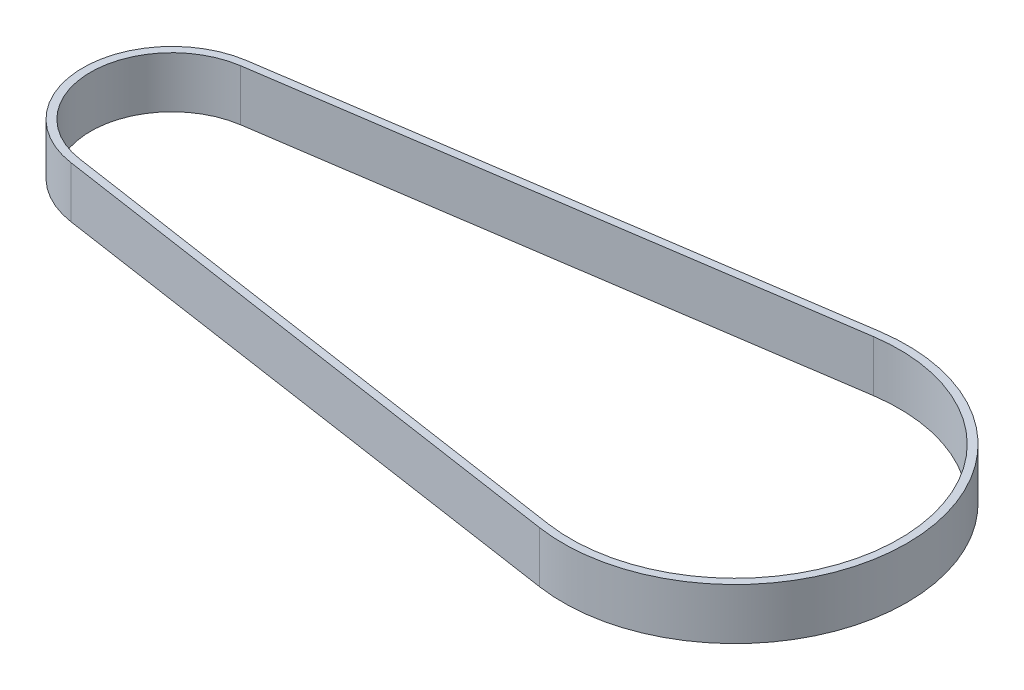
ISO-10303-21;
HEADER;
FILE_DESCRIPTION(('STEP AP214'),'2;1');
FILE_NAME('part.step','',(''),(''),'','','');
FILE_SCHEMA(('AUTOMOTIVE_DESIGN { 1 0 10303 214 1 1 1 1 }'));
ENDSEC;
DATA;
#1=APPLICATION_CONTEXT('core data for automotive mechanical design processes');
#2=APPLICATION_PROTOCOL_DEFINITION('international standard','automotive_design',2000,#1);
#3=PRODUCT_CONTEXT('',#1,'mechanical');
#4=PRODUCT('Part','Part','',(#3));
#5=PRODUCT_RELATED_PRODUCT_CATEGORY('part','',(#4));
#6=PRODUCT_DEFINITION_FORMATION('','',#4);
#7=PRODUCT_DEFINITION_CONTEXT('part definition',#1,'design');
#8=PRODUCT_DEFINITION('design','',#6,#7);
#9=PRODUCT_DEFINITION_SHAPE('','',#8);
#10=(LENGTH_UNIT() NAMED_UNIT(*) SI_UNIT(.MILLI.,.METRE.));
#11=(NAMED_UNIT(*) PLANE_ANGLE_UNIT() SI_UNIT($,.RADIAN.));
#12=(NAMED_UNIT(*) SI_UNIT($,.STERADIAN.) SOLID_ANGLE_UNIT());
#13=UNCERTAINTY_MEASURE_WITH_UNIT(LENGTH_MEASURE(1.E-05),#10,'distance_accuracy_value','');
#14=(GEOMETRIC_REPRESENTATION_CONTEXT(3) GLOBAL_UNCERTAINTY_ASSIGNED_CONTEXT((#13)) GLOBAL_UNIT_ASSIGNED_CONTEXT((#10,
#11,#12)) REPRESENTATION_CONTEXT('',''));
#15=CARTESIAN_POINT('',(0.,0.,0.));
#16=DIRECTION('',(0.,0.,1.));
#17=DIRECTION('',(1.,0.,0.));
#18=AXIS2_PLACEMENT_3D('',#15,#16,#17);
#19=CARTESIAN_POINT('',(-71.6145937328295,10.,0.));
#20=DIRECTION('',(0.,1.,0.));
#21=DIRECTION('',(0.,0.,1.));
#22=AXIS2_PLACEMENT_3D('',#19,#20,#21);
#23=PLANE('',#22);
#24=CARTESIAN_POINT('',(-71.6145937328295,10.,0.));
#25=DIRECTION('',(0.,1.,0.));
#26=DIRECTION('',(0.,0.,1.));
#27=AXIS2_PLACEMENT_3D('',#24,#25,#26);
#28=CIRCLE('',#27,17.415);
#29=CARTESIAN_POINT('',(-74.1745987328295,10.,-17.2258120098872));
#30=VERTEX_POINT('',#29);
#31=CARTESIAN_POINT('',(-74.1745987328296,10.,17.2258120098872));
#32=VERTEX_POINT('',#31);
#33=EDGE_CURVE('E153',#30,#32,#28,.T.);
#34=ORIENTED_EDGE('',*,*,#33,.T.);
#35=DIRECTION('',(0.989136492098032,0.,0.147));
#36=VECTOR('',#35,1.);
#37=CARTESIAN_POINT('',(-74.1745987328296,10.,17.2258120098872));
#38=LINE('',#37,#36);
#39=CARTESIAN_POINT('',(33.4484112671705,10.,33.2201490871124));
#40=VERTEX_POINT('',#39);
#41=EDGE_CURVE('E157',#32,#40,#38,.T.);
#42=ORIENTED_EDGE('',*,*,#41,.T.);
#43=CARTESIAN_POINT('',(38.3854062671705,10.,0.));
#44=DIRECTION('',(0.,1.,0.));
#45=DIRECTION('',(0.,0.,1.));
#46=AXIS2_PLACEMENT_3D('',#43,#44,#45);
#47=CIRCLE('',#46,33.585);
#48=CARTESIAN_POINT('',(33.4484112671705,10.,-33.2201490871124));
#49=VERTEX_POINT('',#48);
#50=EDGE_CURVE('E161',#40,#49,#47,.T.);
#51=ORIENTED_EDGE('',*,*,#50,.T.);
#52=DIRECTION('',(-0.989136492098032,0.,0.147));
#53=VECTOR('',#52,1.);
#54=CARTESIAN_POINT('',(-74.1745987328295,10.,-17.2258120098872));
#55=LINE('',#54,#53);
#56=EDGE_CURVE('E164',#49,#30,#55,.T.);
#57=ORIENTED_EDGE('',*,*,#56,.T.);
#58=EDGE_LOOP('',(#34,#42,#51,#57));
#59=FACE_BOUND('',#58,.T.);
#60=DIRECTION('',(0.989136492098032,0.,0.147));
#61=VECTOR('',#60,1.);
#62=CARTESIAN_POINT('',(-73.9540987328296,10.,15.7421072717402));
#63=LINE('',#62,#61);
#64=CARTESIAN_POINT('',(-73.9540987328296,10.,15.7421072717402));
#65=VERTEX_POINT('',#64);
#66=CARTESIAN_POINT('',(33.6689112671704,10.,31.7364443489654));
#67=VERTEX_POINT('',#66);
#68=EDGE_CURVE('E114',#65,#67,#63,.T.);
#69=ORIENTED_EDGE('',*,*,#68,.F.);
#70=CARTESIAN_POINT('',(-71.6145937328295,10.,0.));
#71=DIRECTION('',(0.,1.,0.));
#72=DIRECTION('',(0.,0.,1.));
#73=AXIS2_PLACEMENT_3D('',#70,#71,#72);
#74=CIRCLE('',#73,15.915);
#75=CARTESIAN_POINT('',(-73.9540987328296,10.,-15.7421072717402));
#76=VERTEX_POINT('',#75);
#77=EDGE_CURVE('E105',#76,#65,#74,.T.);
#78=ORIENTED_EDGE('',*,*,#77,.F.);
#79=DIRECTION('',(-0.989136492098032,0.,0.147));
#80=VECTOR('',#79,1.);
#81=CARTESIAN_POINT('',(-73.9540987328296,10.,-15.7421072717402));
#82=LINE('',#81,#80);
#83=CARTESIAN_POINT('',(33.6689112671705,10.,-31.7364443489653));
#84=VERTEX_POINT('',#83);
#85=EDGE_CURVE('E131',#84,#76,#82,.T.);
#86=ORIENTED_EDGE('',*,*,#85,.F.);
#87=CARTESIAN_POINT('',(38.3854062671705,10.,0.));
#88=DIRECTION('',(0.,1.,0.));
#89=DIRECTION('',(0.,0.,1.));
#90=AXIS2_PLACEMENT_3D('',#87,#88,#89);
#91=CIRCLE('',#90,32.085);
#92=EDGE_CURVE('E127',#67,#84,#91,.T.);
#93=ORIENTED_EDGE('',*,*,#92,.F.);
#94=EDGE_LOOP('',(#69,#78,#86,#93));
#95=FACE_BOUND('',#94,.T.);
#96=ADVANCED_FACE('F39',(#59,#95),#23,.T.);
#97=CARTESIAN_POINT('',(-71.6145937328295,0.,0.));
#98=DIRECTION('',(0.,1.,0.));
#99=DIRECTION('',(0.,0.,1.));
#100=AXIS2_PLACEMENT_3D('',#97,#98,#99);
#101=PLANE('',#100);
#102=CARTESIAN_POINT('',(-71.6145937328295,0.,0.));
#103=DIRECTION('',(0.,1.,0.));
#104=DIRECTION('',(0.,0.,1.));
#105=AXIS2_PLACEMENT_3D('',#102,#103,#104);
#106=CIRCLE('',#105,17.415);
#107=CARTESIAN_POINT('',(-74.1745987328295,0.,-17.2258120098872));
#108=VERTEX_POINT('',#107);
#109=CARTESIAN_POINT('',(-74.1745987328296,0.,17.2258120098872));
#110=VERTEX_POINT('',#109);
#111=EDGE_CURVE('E123',#108,#110,#106,.T.);
#112=ORIENTED_EDGE('',*,*,#111,.F.);
#113=DIRECTION('',(-0.989136492098032,0.,0.147));
#114=VECTOR('',#113,1.);
#115=CARTESIAN_POINT('',(-74.1745987328295,0.,-17.2258120098872));
#116=LINE('',#115,#114);
#117=CARTESIAN_POINT('',(33.4484112671705,0.,-33.2201490871124));
#118=VERTEX_POINT('',#117);
#119=EDGE_CURVE('E158',#118,#108,#116,.T.);
#120=ORIENTED_EDGE('',*,*,#119,.F.);
#121=CARTESIAN_POINT('',(38.3854062671705,0.,0.));
#122=DIRECTION('',(0.,1.,0.));
#123=DIRECTION('',(0.,0.,1.));
#124=AXIS2_PLACEMENT_3D('',#121,#122,#123);
#125=CIRCLE('',#124,33.585);
#126=CARTESIAN_POINT('',(33.4484112671705,0.,33.2201490871124));
#127=VERTEX_POINT('',#126);
#128=EDGE_CURVE('E174',#127,#118,#125,.T.);
#129=ORIENTED_EDGE('',*,*,#128,.F.);
#130=DIRECTION('',(0.989136492098032,0.,0.147));
#131=VECTOR('',#130,1.);
#132=CARTESIAN_POINT('',(-74.1745987328296,0.,17.2258120098872));
#133=LINE('',#132,#131);
#134=EDGE_CURVE('E171',#110,#127,#133,.T.);
#135=ORIENTED_EDGE('',*,*,#134,.F.);
#136=EDGE_LOOP('',(#112,#120,#129,#135));
#137=FACE_BOUND('',#136,.T.);
#138=CARTESIAN_POINT('',(-71.6145937328295,0.,0.));
#139=DIRECTION('',(0.,1.,0.));
#140=DIRECTION('',(0.,0.,1.));
#141=AXIS2_PLACEMENT_3D('',#138,#139,#140);
#142=CIRCLE('',#141,15.915);
#143=CARTESIAN_POINT('',(-73.9540987328296,0.,-15.7421072717402));
#144=VERTEX_POINT('',#143);
#145=CARTESIAN_POINT('',(-73.9540987328296,0.,15.7421072717402));
#146=VERTEX_POINT('',#145);
#147=EDGE_CURVE('E63',#144,#146,#142,.T.);
#148=ORIENTED_EDGE('',*,*,#147,.T.);
#149=DIRECTION('',(0.989136492098032,0.,0.147));
#150=VECTOR('',#149,1.);
#151=CARTESIAN_POINT('',(-73.9540987328296,0.,15.7421072717402));
#152=LINE('',#151,#150);
#153=CARTESIAN_POINT('',(33.6689112671704,0.,31.7364443489654));
#154=VERTEX_POINT('',#153);
#155=EDGE_CURVE('E121',#146,#154,#152,.T.);
#156=ORIENTED_EDGE('',*,*,#155,.T.);
#157=CARTESIAN_POINT('',(38.3854062671705,0.,0.));
#158=DIRECTION('',(0.,1.,0.));
#159=DIRECTION('',(0.,0.,1.));
#160=AXIS2_PLACEMENT_3D('',#157,#158,#159);
#161=CIRCLE('',#160,32.085);
#162=CARTESIAN_POINT('',(33.6689112671705,0.,-31.7364443489653));
#163=VERTEX_POINT('',#162);
#164=EDGE_CURVE('E140',#154,#163,#161,.T.);
#165=ORIENTED_EDGE('',*,*,#164,.T.);
#166=DIRECTION('',(-0.989136492098032,0.,0.147));
#167=VECTOR('',#166,1.);
#168=CARTESIAN_POINT('',(-73.9540987328296,0.,-15.7421072717402));
#169=LINE('',#168,#167);
#170=EDGE_CURVE('E115',#163,#144,#169,.T.);
#171=ORIENTED_EDGE('',*,*,#170,.T.);
#172=EDGE_LOOP('',(#148,#156,#165,#171));
#173=FACE_BOUND('',#172,.T.);
#174=ADVANCED_FACE('F197',(#137,#173),#101,.F.);
#175=CARTESIAN_POINT('',(-71.6145937328295,10.,0.));
#176=DIRECTION('',(0.,-1.,0.));
#177=DIRECTION('',(0.,0.,-1.));
#178=AXIS2_PLACEMENT_3D('',#175,#176,#177);
#179=CYLINDRICAL_SURFACE('',#178,17.415);
#180=ORIENTED_EDGE('',*,*,#111,.T.);
#181=DIRECTION('',(0.,-1.,0.));
#182=VECTOR('',#181,1.);
#183=CARTESIAN_POINT('',(-74.1745987328296,10.,17.2258120098872));
#184=LINE('',#183,#182);
#185=EDGE_CURVE('E11',#32,#110,#184,.T.);
#186=ORIENTED_EDGE('',*,*,#185,.F.);
#187=ORIENTED_EDGE('',*,*,#33,.F.);
#188=DIRECTION('',(0.,-1.,0.));
#189=VECTOR('',#188,1.);
#190=CARTESIAN_POINT('',(-74.1745987328295,10.,-17.2258120098872));
#191=LINE('',#190,#189);
#192=EDGE_CURVE('E167',#30,#108,#191,.T.);
#193=ORIENTED_EDGE('',*,*,#192,.T.);
#194=EDGE_LOOP('',(#180,#186,#187,#193));
#195=FACE_BOUND('',#194,.T.);
#196=ADVANCED_FACE('F41',(#195),#179,.T.);
#197=CARTESIAN_POINT('',(-74.1745987328296,10.,17.2258120098872));
#198=DIRECTION('',(0.147,0.,-0.989136492098032));
#199=DIRECTION('',(-0.989136492098032,0.,-0.147));
#200=AXIS2_PLACEMENT_3D('',#197,#198,#199);
#201=PLANE('',#200);
#202=ORIENTED_EDGE('',*,*,#134,.T.);
#203=DIRECTION('',(0.,-1.,0.));
#204=VECTOR('',#203,1.);
#205=CARTESIAN_POINT('',(33.4484112671705,10.,33.2201490871124));
#206=LINE('',#205,#204);
#207=EDGE_CURVE('E48',#40,#127,#206,.T.);
#208=ORIENTED_EDGE('',*,*,#207,.F.);
#209=ORIENTED_EDGE('',*,*,#41,.F.);
#210=ORIENTED_EDGE('',*,*,#185,.T.);
#211=EDGE_LOOP('',(#202,#208,#209,#210));
#212=FACE_BOUND('',#211,.T.);
#213=ADVANCED_FACE('F207',(#212),#201,.F.);
#214=CARTESIAN_POINT('',(38.3854062671705,10.,0.));
#215=DIRECTION('',(0.,-1.,0.));
#216=DIRECTION('',(0.,0.,-1.));
#217=AXIS2_PLACEMENT_3D('',#214,#215,#216);
#218=CYLINDRICAL_SURFACE('',#217,33.585);
#219=ORIENTED_EDGE('',*,*,#128,.T.);
#220=DIRECTION('',(0.,-1.,0.));
#221=VECTOR('',#220,1.);
#222=CARTESIAN_POINT('',(33.4484112671705,10.,-33.2201490871124));
#223=LINE('',#222,#221);
#224=EDGE_CURVE('E182',#49,#118,#223,.T.);
#225=ORIENTED_EDGE('',*,*,#224,.F.);
#226=ORIENTED_EDGE('',*,*,#50,.F.);
#227=ORIENTED_EDGE('',*,*,#207,.T.);
#228=EDGE_LOOP('',(#219,#225,#226,#227));
#229=FACE_BOUND('',#228,.T.);
#230=ADVANCED_FACE('F191',(#229),#218,.T.);
#231=CARTESIAN_POINT('',(-74.1745987328295,10.,-17.2258120098872));
#232=DIRECTION('',(0.147,0.,0.989136492098032));
#233=DIRECTION('',(0.989136492098032,0.,-0.147));
#234=AXIS2_PLACEMENT_3D('',#231,#232,#233);
#235=PLANE('',#234);
#236=ORIENTED_EDGE('',*,*,#119,.T.);
#237=ORIENTED_EDGE('',*,*,#192,.F.);
#238=ORIENTED_EDGE('',*,*,#56,.F.);
#239=ORIENTED_EDGE('',*,*,#224,.T.);
#240=EDGE_LOOP('',(#236,#237,#238,#239));
#241=FACE_BOUND('',#240,.T.);
#242=ADVANCED_FACE('F201',(#241),#235,.F.);
#243=CARTESIAN_POINT('',(-71.6145937328295,10.,0.));
#244=DIRECTION('',(0.,-1.,0.));
#245=DIRECTION('',(0.,0.,-1.));
#246=AXIS2_PLACEMENT_3D('',#243,#244,#245);
#247=CYLINDRICAL_SURFACE('',#246,15.915);
#248=ORIENTED_EDGE('',*,*,#147,.F.);
#249=DIRECTION('',(0.,-1.,0.));
#250=VECTOR('',#249,1.);
#251=CARTESIAN_POINT('',(-73.9540987328296,10.,-15.7421072717402));
#252=LINE('',#251,#250);
#253=EDGE_CURVE('E109',#76,#144,#252,.T.);
#254=ORIENTED_EDGE('',*,*,#253,.F.);
#255=ORIENTED_EDGE('',*,*,#77,.T.);
#256=DIRECTION('',(0.,-1.,0.));
#257=VECTOR('',#256,1.);
#258=CARTESIAN_POINT('',(-73.9540987328296,10.,15.7421072717402));
#259=LINE('',#258,#257);
#260=EDGE_CURVE('E108',#65,#146,#259,.T.);
#261=ORIENTED_EDGE('',*,*,#260,.T.);
#262=EDGE_LOOP('',(#248,#254,#255,#261));
#263=FACE_BOUND('',#262,.T.);
#264=ADVANCED_FACE('F107',(#263),#247,.F.);
#265=CARTESIAN_POINT('',(-73.9540987328296,10.,15.7421072717402));
#266=DIRECTION('',(0.147,0.,-0.989136492098032));
#267=DIRECTION('',(-0.989136492098032,0.,-0.147));
#268=AXIS2_PLACEMENT_3D('',#265,#266,#267);
#269=PLANE('',#268);
#270=ORIENTED_EDGE('',*,*,#155,.F.);
#271=ORIENTED_EDGE('',*,*,#260,.F.);
#272=ORIENTED_EDGE('',*,*,#68,.T.);
#273=DIRECTION('',(0.,-1.,0.));
#274=VECTOR('',#273,1.);
#275=CARTESIAN_POINT('',(33.6689112671704,10.,31.7364443489654));
#276=LINE('',#275,#274);
#277=EDGE_CURVE('E124',#67,#154,#276,.T.);
#278=ORIENTED_EDGE('',*,*,#277,.T.);
#279=EDGE_LOOP('',(#270,#271,#272,#278));
#280=FACE_BOUND('',#279,.T.);
#281=ADVANCED_FACE('F118',(#280),#269,.T.);
#282=CARTESIAN_POINT('',(38.3854062671705,10.,0.));
#283=DIRECTION('',(0.,-1.,0.));
#284=DIRECTION('',(0.,0.,-1.));
#285=AXIS2_PLACEMENT_3D('',#282,#283,#284);
#286=CYLINDRICAL_SURFACE('',#285,32.085);
#287=ORIENTED_EDGE('',*,*,#164,.F.);
#288=ORIENTED_EDGE('',*,*,#277,.F.);
#289=ORIENTED_EDGE('',*,*,#92,.T.);
#290=DIRECTION('',(0.,-1.,0.));
#291=VECTOR('',#290,1.);
#292=CARTESIAN_POINT('',(33.6689112671705,10.,-31.7364443489653));
#293=LINE('',#292,#291);
#294=EDGE_CURVE('E55',#84,#163,#293,.T.);
#295=ORIENTED_EDGE('',*,*,#294,.T.);
#296=EDGE_LOOP('',(#287,#288,#289,#295));
#297=FACE_BOUND('',#296,.T.);
#298=ADVANCED_FACE('F230',(#297),#286,.F.);
#299=CARTESIAN_POINT('',(-73.9540987328296,10.,-15.7421072717402));
#300=DIRECTION('',(0.147,0.,0.989136492098032));
#301=DIRECTION('',(0.989136492098032,0.,-0.147));
#302=AXIS2_PLACEMENT_3D('',#299,#300,#301);
#303=PLANE('',#302);
#304=ORIENTED_EDGE('',*,*,#170,.F.);
#305=ORIENTED_EDGE('',*,*,#294,.F.);
#306=ORIENTED_EDGE('',*,*,#85,.T.);
#307=ORIENTED_EDGE('',*,*,#253,.T.);
#308=EDGE_LOOP('',(#304,#305,#306,#307));
#309=FACE_BOUND('',#308,.T.);
#310=ADVANCED_FACE('F234',(#309),#303,.T.);
#311=CLOSED_SHELL('',(#96,#174,#196,#213,#230,#242,#264,#281,#298,#310));
#312=MANIFOLD_SOLID_BREP('B2',#311);
#313=ADVANCED_BREP_SHAPE_REPRESENTATION('',(#18,#312),#14);
#314=SHAPE_DEFINITION_REPRESENTATION(#9,#313);
ENDSEC;
END-ISO-10303-21;
